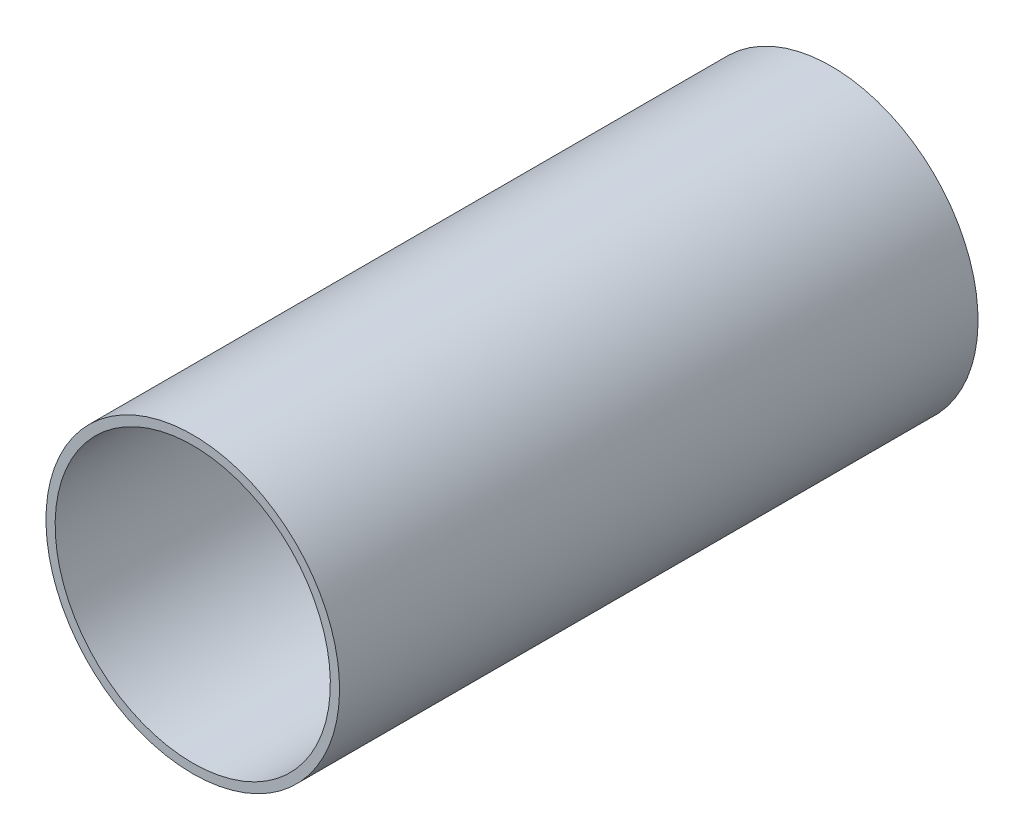
ISO-10303-21;
HEADER;
FILE_DESCRIPTION(('STEP AP214'),'2;1');
FILE_NAME('part.step','',(''),(''),'','','');
FILE_SCHEMA(('AUTOMOTIVE_DESIGN { 1 0 10303 214 1 1 1 1 }'));
ENDSEC;
DATA;
#1=APPLICATION_CONTEXT('core data for automotive mechanical design processes');
#2=APPLICATION_PROTOCOL_DEFINITION('international standard','automotive_design',2000,#1);
#3=PRODUCT_CONTEXT('',#1,'mechanical');
#4=PRODUCT('Part','Part','',(#3));
#5=PRODUCT_RELATED_PRODUCT_CATEGORY('part','',(#4));
#6=PRODUCT_DEFINITION_FORMATION('','',#4);
#7=PRODUCT_DEFINITION_CONTEXT('part definition',#1,'design');
#8=PRODUCT_DEFINITION('design','',#6,#7);
#9=PRODUCT_DEFINITION_SHAPE('','',#8);
#10=(LENGTH_UNIT() NAMED_UNIT(*) SI_UNIT(.MILLI.,.METRE.));
#11=(NAMED_UNIT(*) PLANE_ANGLE_UNIT() SI_UNIT($,.RADIAN.));
#12=(NAMED_UNIT(*) SI_UNIT($,.STERADIAN.) SOLID_ANGLE_UNIT());
#13=UNCERTAINTY_MEASURE_WITH_UNIT(LENGTH_MEASURE(1.E-05),#10,'distance_accuracy_value','');
#14=(GEOMETRIC_REPRESENTATION_CONTEXT(3) GLOBAL_UNCERTAINTY_ASSIGNED_CONTEXT((#13)) GLOBAL_UNIT_ASSIGNED_CONTEXT((#10,
#11,#12)) REPRESENTATION_CONTEXT('',''));
#15=CARTESIAN_POINT('',(0.,0.,0.));
#16=DIRECTION('',(0.,0.,1.));
#17=DIRECTION('',(1.,0.,0.));
#18=AXIS2_PLACEMENT_3D('',#15,#16,#17);
#19=CARTESIAN_POINT('',(144.78,-80.772,-0.045));
#20=DIRECTION('',(0.,0.,-1.));
#21=DIRECTION('',(0.,-1.,0.));
#22=AXIS2_PLACEMENT_3D('',#19,#20,#21);
#23=CYLINDRICAL_SURFACE('',#22,0.375);
#24=CARTESIAN_POINT('',(144.78,-80.772,-0.035));
#25=DIRECTION('',(0.,0.,-1.));
#26=DIRECTION('',(0.,-1.,0.));
#27=AXIS2_PLACEMENT_3D('',#24,#25,#26);
#28=CIRCLE('',#27,0.375);
#29=CARTESIAN_POINT('',(144.78,-81.147,-0.035));
#30=VERTEX_POINT('',#29);
#31=EDGE_CURVE('E53',#30,#30,#28,.T.);
#32=ORIENTED_EDGE('',*,*,#31,.T.);
#33=DIRECTION('',(0.,0.,1.));
#34=VECTOR('',#33,1.);
#35=CARTESIAN_POINT('',(144.78,-81.147,-0.045));
#36=LINE('',#35,#34);
#37=CARTESIAN_POINT('',(144.78,-81.147,1.705));
#38=VERTEX_POINT('',#37);
#39=EDGE_CURVE('E11',#30,#38,#36,.T.);
#40=ORIENTED_EDGE('',*,*,#39,.T.);
#41=CARTESIAN_POINT('',(144.78,-80.772,1.705));
#42=DIRECTION('',(0.,0.,-1.));
#43=DIRECTION('',(0.,-1.,0.));
#44=AXIS2_PLACEMENT_3D('',#41,#42,#43);
#45=CIRCLE('',#44,0.375);
#46=EDGE_CURVE('E27',#38,#38,#45,.T.);
#47=ORIENTED_EDGE('',*,*,#46,.F.);
#48=ORIENTED_EDGE('',*,*,#39,.F.);
#49=EDGE_LOOP('',(#32,#40,#47,#48));
#50=FACE_BOUND('',#49,.T.);
#51=ADVANCED_FACE('F17',(#50),#23,.F.);
#52=CARTESIAN_POINT('',(144.78,-81.172,1.705));
#53=DIRECTION('',(0.,0.,1.));
#54=DIRECTION('',(1.,0.,0.));
#55=AXIS2_PLACEMENT_3D('',#52,#53,#54);
#56=PLANE('',#55);
#57=ORIENTED_EDGE('',*,*,#46,.T.);
#58=EDGE_LOOP('',(#57));
#59=FACE_BOUND('',#58,.T.);
#60=CARTESIAN_POINT('',(144.78,-80.772,1.705));
#61=DIRECTION('',(0.,0.,1.));
#62=DIRECTION('',(0.,-1.,0.));
#63=AXIS2_PLACEMENT_3D('',#60,#61,#62);
#64=CIRCLE('',#63,0.4);
#65=CARTESIAN_POINT('',(144.78,-81.172,1.705));
#66=VERTEX_POINT('',#65);
#67=EDGE_CURVE('E49',#66,#66,#64,.T.);
#68=ORIENTED_EDGE('',*,*,#67,.T.);
#69=EDGE_LOOP('',(#68));
#70=FACE_BOUND('',#69,.T.);
#71=ADVANCED_FACE('F19',(#59,#70),#56,.T.);
#72=CARTESIAN_POINT('',(144.78,-81.172,-0.035));
#73=DIRECTION('',(0.,0.,1.));
#74=DIRECTION('',(1.,0.,0.));
#75=AXIS2_PLACEMENT_3D('',#72,#73,#74);
#76=PLANE('',#75);
#77=ORIENTED_EDGE('',*,*,#31,.F.);
#78=EDGE_LOOP('',(#77));
#79=FACE_BOUND('',#78,.T.);
#80=CARTESIAN_POINT('',(144.78,-80.772,-0.035));
#81=DIRECTION('',(0.,0.,1.));
#82=DIRECTION('',(0.,-1.,0.));
#83=AXIS2_PLACEMENT_3D('',#80,#81,#82);
#84=CIRCLE('',#83,0.4);
#85=CARTESIAN_POINT('',(144.78,-81.172,-0.035));
#86=VERTEX_POINT('',#85);
#87=EDGE_CURVE('E62',#86,#86,#84,.T.);
#88=ORIENTED_EDGE('',*,*,#87,.F.);
#89=EDGE_LOOP('',(#88));
#90=FACE_BOUND('',#89,.T.);
#91=ADVANCED_FACE('F71',(#79,#90),#76,.F.);
#92=CARTESIAN_POINT('',(144.78,-80.772,-0.035));
#93=DIRECTION('',(0.,0.,-1.));
#94=DIRECTION('',(0.,-1.,0.));
#95=AXIS2_PLACEMENT_3D('',#92,#93,#94);
#96=CYLINDRICAL_SURFACE('',#95,0.4);
#97=ORIENTED_EDGE('',*,*,#87,.T.);
#98=DIRECTION('',(0.,0.,1.));
#99=VECTOR('',#98,1.);
#100=CARTESIAN_POINT('',(144.78,-81.172,-0.035));
#101=LINE('',#100,#99);
#102=EDGE_CURVE('E54',#86,#66,#101,.T.);
#103=ORIENTED_EDGE('',*,*,#102,.T.);
#104=ORIENTED_EDGE('',*,*,#67,.F.);
#105=ORIENTED_EDGE('',*,*,#102,.F.);
#106=EDGE_LOOP('',(#97,#103,#104,#105));
#107=FACE_BOUND('',#106,.T.);
#108=ADVANCED_FACE('F74',(#107),#96,.T.);
#109=CLOSED_SHELL('',(#51,#71,#91,#108));
#110=MANIFOLD_SOLID_BREP('B1',#109);
#111=ADVANCED_BREP_SHAPE_REPRESENTATION('',(#18,#110),#14);
#112=SHAPE_DEFINITION_REPRESENTATION(#9,#111);
ENDSEC;
END-ISO-10303-21;
